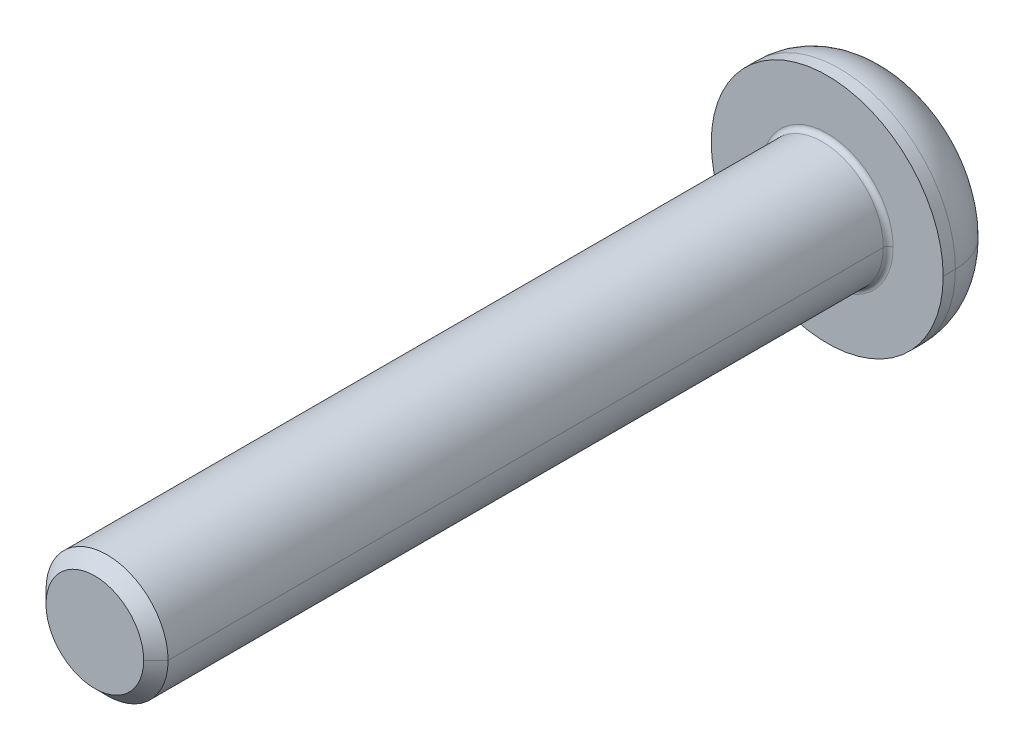
ISO-10303-21;
HEADER;
FILE_DESCRIPTION(('STEP AP214'),'2;1');
FILE_NAME('part.step','',(''),(''),'','','');
FILE_SCHEMA(('AUTOMOTIVE_DESIGN { 1 0 10303 214 1 1 1 1 }'));
ENDSEC;
DATA;
#1=APPLICATION_CONTEXT('core data for automotive mechanical design processes');
#2=APPLICATION_PROTOCOL_DEFINITION('international standard','automotive_design',2000,#1);
#3=PRODUCT_CONTEXT('',#1,'mechanical');
#4=PRODUCT('Part','Part','',(#3));
#5=PRODUCT_RELATED_PRODUCT_CATEGORY('part','',(#4));
#6=PRODUCT_DEFINITION_FORMATION('','',#4);
#7=PRODUCT_DEFINITION_CONTEXT('part definition',#1,'design');
#8=PRODUCT_DEFINITION('design','',#6,#7);
#9=PRODUCT_DEFINITION_SHAPE('','',#8);
#10=(LENGTH_UNIT() NAMED_UNIT(*) SI_UNIT(.MILLI.,.METRE.));
#11=(NAMED_UNIT(*) PLANE_ANGLE_UNIT() SI_UNIT($,.RADIAN.));
#12=(NAMED_UNIT(*) SI_UNIT($,.STERADIAN.) SOLID_ANGLE_UNIT());
#13=UNCERTAINTY_MEASURE_WITH_UNIT(LENGTH_MEASURE(1.E-05),#10,'distance_accuracy_value','');
#14=(GEOMETRIC_REPRESENTATION_CONTEXT(3) GLOBAL_UNCERTAINTY_ASSIGNED_CONTEXT((#13)) GLOBAL_UNIT_ASSIGNED_CONTEXT((#10,
#11,#12)) REPRESENTATION_CONTEXT('',''));
#15=CARTESIAN_POINT('',(0.,0.,0.));
#16=DIRECTION('',(0.,0.,1.));
#17=DIRECTION('',(1.,0.,0.));
#18=AXIS2_PLACEMENT_3D('',#15,#16,#17);
#19=CARTESIAN_POINT('',(0.,0.,0.2));
#20=DIRECTION('',(0.,0.,-1.));
#21=DIRECTION('',(-1.,0.,0.));
#22=AXIS2_PLACEMENT_3D('',#19,#20,#21);
#23=TOROIDAL_SURFACE('',#22,2.7,0.2);
#24=CARTESIAN_POINT('',(2.7,0.,0.2));
#25=DIRECTION('',(0.,1.,0.));
#26=DIRECTION('',(-1.,0.,0.));
#27=AXIS2_PLACEMENT_3D('',#24,#25,#26);
#28=CIRCLE('',#27,0.2);
#29=CARTESIAN_POINT('',(2.7,0.,0.));
#30=VERTEX_POINT('',#29);
#31=CARTESIAN_POINT('',(2.5,0.,0.2));
#32=VERTEX_POINT('',#31);
#33=EDGE_CURVE('E324',#30,#32,#28,.T.);
#34=ORIENTED_EDGE('',*,*,#33,.F.);
#35=CARTESIAN_POINT('',(0.,0.,0.));
#36=DIRECTION('',(0.,0.,-1.));
#37=DIRECTION('',(-1.,0.,0.));
#38=AXIS2_PLACEMENT_3D('',#35,#36,#37);
#39=CIRCLE('',#38,2.7);
#40=CARTESIAN_POINT('',(-2.7,0.,0.));
#41=VERTEX_POINT('',#40);
#42=EDGE_CURVE('E264',#41,#30,#39,.T.);
#43=ORIENTED_EDGE('',*,*,#42,.F.);
#44=CARTESIAN_POINT('',(-2.7,0.,0.2));
#45=DIRECTION('',(0.,-1.,0.));
#46=DIRECTION('',(0.,0.,-1.));
#47=AXIS2_PLACEMENT_3D('',#44,#45,#46);
#48=CIRCLE('',#47,0.2);
#49=CARTESIAN_POINT('',(-2.5,0.,0.2));
#50=VERTEX_POINT('',#49);
#51=EDGE_CURVE('E170',#41,#50,#48,.T.);
#52=ORIENTED_EDGE('',*,*,#51,.T.);
#53=CARTESIAN_POINT('',(0.,0.,0.2));
#54=DIRECTION('',(0.,0.,1.));
#55=DIRECTION('',(-1.,0.,0.));
#56=AXIS2_PLACEMENT_3D('',#53,#54,#55);
#57=CIRCLE('',#56,2.5);
#58=EDGE_CURVE('E197',#32,#50,#57,.T.);
#59=ORIENTED_EDGE('',*,*,#58,.F.);
#60=EDGE_LOOP('',(#34,#43,#52,#59));
#61=FACE_BOUND('',#60,.T.);
#62=ADVANCED_FACE('F18',(#61),#23,.F.);
#63=CARTESIAN_POINT('',(0.,0.,30.));
#64=DIRECTION('',(0.,0.,-1.));
#65=DIRECTION('',(-1.,0.,0.));
#66=AXIS2_PLACEMENT_3D('',#63,#64,#65);
#67=CONICAL_SURFACE('',#66,2.,0.785398163397446);
#68=DIRECTION('',(0.707106781186546,0.,-0.707106781186549));
#69=VECTOR('',#68,1.);
#70=CARTESIAN_POINT('',(2.,0.,30.));
#71=LINE('',#70,#69);
#72=CARTESIAN_POINT('',(2.,0.,30.));
#73=VERTEX_POINT('',#72);
#74=CARTESIAN_POINT('',(2.5,0.,29.5));
#75=VERTEX_POINT('',#74);
#76=EDGE_CURVE('E159',#73,#75,#71,.T.);
#77=ORIENTED_EDGE('',*,*,#76,.F.);
#78=CARTESIAN_POINT('',(0.,0.,30.));
#79=DIRECTION('',(0.,0.,1.));
#80=DIRECTION('',(1.,0.,0.));
#81=AXIS2_PLACEMENT_3D('',#78,#79,#80);
#82=CIRCLE('',#81,2.);
#83=CARTESIAN_POINT('',(-2.,0.,30.));
#84=VERTEX_POINT('',#83);
#85=EDGE_CURVE('E146',#84,#73,#82,.T.);
#86=ORIENTED_EDGE('',*,*,#85,.F.);
#87=DIRECTION('',(-0.707106781186546,0.,-0.707106781186549));
#88=VECTOR('',#87,1.);
#89=CARTESIAN_POINT('',(-2.,0.,30.));
#90=LINE('',#89,#88);
#91=CARTESIAN_POINT('',(-2.5,0.,29.5));
#92=VERTEX_POINT('',#91);
#93=EDGE_CURVE('E168',#84,#92,#90,.T.);
#94=ORIENTED_EDGE('',*,*,#93,.T.);
#95=CARTESIAN_POINT('',(0.,0.,29.5));
#96=DIRECTION('',(0.,0.,-1.));
#97=DIRECTION('',(1.,0.,0.));
#98=AXIS2_PLACEMENT_3D('',#95,#96,#97);
#99=CIRCLE('',#98,2.5);
#100=EDGE_CURVE('E156',#75,#92,#99,.T.);
#101=ORIENTED_EDGE('',*,*,#100,.F.);
#102=EDGE_LOOP('',(#77,#86,#94,#101));
#103=FACE_BOUND('',#102,.T.);
#104=ADVANCED_FACE('F160',(#103),#67,.T.);
#105=CARTESIAN_POINT('',(0.,0.,-0.5));
#106=DIRECTION('',(0.,0.,-1.));
#107=DIRECTION('',(-1.,0.,0.));
#108=AXIS2_PLACEMENT_3D('',#105,#106,#107);
#109=TOROIDAL_SURFACE('',#108,2.5,2.25);
#110=CARTESIAN_POINT('',(2.5,0.,-0.5));
#111=DIRECTION('',(0.,1.,0.));
#112=DIRECTION('',(-1.,0.,0.));
#113=AXIS2_PLACEMENT_3D('',#110,#111,#112);
#114=CIRCLE('',#113,2.25);
#115=CARTESIAN_POINT('',(4.75,0.,-0.5));
#116=VERTEX_POINT('',#115);
#117=CARTESIAN_POINT('',(2.5,0.,-2.75));
#118=VERTEX_POINT('',#117);
#119=EDGE_CURVE('E182',#116,#118,#114,.T.);
#120=ORIENTED_EDGE('',*,*,#119,.F.);
#121=CARTESIAN_POINT('',(0.,0.,-0.5));
#122=DIRECTION('',(0.,0.,1.));
#123=DIRECTION('',(-1.,0.,0.));
#124=AXIS2_PLACEMENT_3D('',#121,#122,#123);
#125=CIRCLE('',#124,4.75);
#126=CARTESIAN_POINT('',(-4.75,0.,-0.5));
#127=VERTEX_POINT('',#126);
#128=EDGE_CURVE('E155',#127,#116,#125,.T.);
#129=ORIENTED_EDGE('',*,*,#128,.F.);
#130=CARTESIAN_POINT('',(-2.5,0.,-0.5));
#131=DIRECTION('',(0.,-1.,0.));
#132=DIRECTION('',(0.,0.,-1.));
#133=AXIS2_PLACEMENT_3D('',#130,#131,#132);
#134=CIRCLE('',#133,2.25);
#135=CARTESIAN_POINT('',(-2.5,0.,-2.75));
#136=VERTEX_POINT('',#135);
#137=EDGE_CURVE('E207',#127,#136,#134,.T.);
#138=ORIENTED_EDGE('',*,*,#137,.T.);
#139=CARTESIAN_POINT('',(0.,0.,-2.75));
#140=DIRECTION('',(0.,0.,-1.));
#141=DIRECTION('',(-1.,0.,0.));
#142=AXIS2_PLACEMENT_3D('',#139,#140,#141);
#143=CIRCLE('',#142,2.5);
#144=EDGE_CURVE('E235',#118,#136,#143,.T.);
#145=ORIENTED_EDGE('',*,*,#144,.F.);
#146=EDGE_LOOP('',(#120,#129,#138,#145));
#147=FACE_BOUND('',#146,.T.);
#148=ADVANCED_FACE('F343',(#147),#109,.T.);
#149=CARTESIAN_POINT('',(0.,0.,-1.19));
#150=DIRECTION('',(0.,0.,-1.));
#151=DIRECTION('',(0.,-1.,0.));
#152=AXIS2_PLACEMENT_3D('',#149,#150,#151);
#153=PLANE('',#152);
#154=DIRECTION('',(-1.,0.,0.));
#155=VECTOR('',#154,1.);
#156=CARTESIAN_POINT('',(0.866025403784439,-1.5,-1.19));
#157=LINE('',#156,#155);
#158=CARTESIAN_POINT('',(0.866025403784439,-1.5,-1.19));
#159=VERTEX_POINT('',#158);
#160=CARTESIAN_POINT('',(-0.866025403784439,-1.5,-1.19));
#161=VERTEX_POINT('',#160);
#162=EDGE_CURVE('E270',#159,#161,#157,.T.);
#163=ORIENTED_EDGE('',*,*,#162,.T.);
#164=DIRECTION('',(-0.5,0.866025403784439,0.));
#165=VECTOR('',#164,1.);
#166=CARTESIAN_POINT('',(-0.866025403784439,-1.5,-1.19));
#167=LINE('',#166,#165);
#168=CARTESIAN_POINT('',(-1.73205080756888,0.,-1.19));
#169=VERTEX_POINT('',#168);
#170=EDGE_CURVE('E11',#161,#169,#167,.T.);
#171=ORIENTED_EDGE('',*,*,#170,.T.);
#172=DIRECTION('',(0.5,0.866025403784439,0.));
#173=VECTOR('',#172,1.);
#174=CARTESIAN_POINT('',(-1.73205080756888,0.,-1.19));
#175=LINE('',#174,#173);
#176=CARTESIAN_POINT('',(-0.86602540378444,1.5,-1.19));
#177=VERTEX_POINT('',#176);
#178=EDGE_CURVE('E47',#169,#177,#175,.T.);
#179=ORIENTED_EDGE('',*,*,#178,.T.);
#180=DIRECTION('',(1.,0.,0.));
#181=VECTOR('',#180,1.);
#182=CARTESIAN_POINT('',(-0.86602540378444,1.5,-1.19));
#183=LINE('',#182,#181);
#184=CARTESIAN_POINT('',(0.866025403784439,1.5,-1.19));
#185=VERTEX_POINT('',#184);
#186=EDGE_CURVE('E282',#177,#185,#183,.T.);
#187=ORIENTED_EDGE('',*,*,#186,.T.);
#188=DIRECTION('',(0.5,-0.866025403784439,0.));
#189=VECTOR('',#188,1.);
#190=CARTESIAN_POINT('',(0.866025403784439,1.5,-1.19));
#191=LINE('',#190,#189);
#192=CARTESIAN_POINT('',(1.73205080756888,0.,-1.19));
#193=VERTEX_POINT('',#192);
#194=EDGE_CURVE('E277',#185,#193,#191,.T.);
#195=ORIENTED_EDGE('',*,*,#194,.T.);
#196=DIRECTION('',(-0.5,-0.866025403784439,0.));
#197=VECTOR('',#196,1.);
#198=CARTESIAN_POINT('',(1.73205080756888,0.,-1.19));
#199=LINE('',#198,#197);
#200=EDGE_CURVE('E188',#193,#159,#199,.T.);
#201=ORIENTED_EDGE('',*,*,#200,.T.);
#202=EDGE_LOOP('',(#163,#171,#179,#187,#195,#201));
#203=FACE_BOUND('',#202,.T.);
#204=ADVANCED_FACE('F309',(#203),#153,.T.);
#205=CARTESIAN_POINT('',(-0.866025403784439,-1.5,-1.19));
#206=DIRECTION('',(-0.866025403784439,-0.5,0.));
#207=DIRECTION('',(-0.5,0.866025403784439,0.));
#208=AXIS2_PLACEMENT_3D('',#205,#206,#207);
#209=PLANE('',#208);
#210=DIRECTION('',(-0.5,0.866025403784439,0.));
#211=VECTOR('',#210,1.);
#212=CARTESIAN_POINT('',(-0.866025403784439,-1.5,-2.75));
#213=LINE('',#212,#211);
#214=CARTESIAN_POINT('',(-0.866025403784439,-1.5,-2.75));
#215=VERTEX_POINT('',#214);
#216=CARTESIAN_POINT('',(-1.73205080756888,0.,-2.75));
#217=VERTEX_POINT('',#216);
#218=EDGE_CURVE('E260',#215,#217,#213,.T.);
#219=ORIENTED_EDGE('',*,*,#218,.T.);
#220=DIRECTION('',(0.,0.,-1.));
#221=VECTOR('',#220,1.);
#222=CARTESIAN_POINT('',(-1.73205080756888,0.,-1.19));
#223=LINE('',#222,#221);
#224=EDGE_CURVE('E27',#169,#217,#223,.T.);
#225=ORIENTED_EDGE('',*,*,#224,.F.);
#226=ORIENTED_EDGE('',*,*,#170,.F.);
#227=DIRECTION('',(0.,0.,-1.));
#228=VECTOR('',#227,1.);
#229=CARTESIAN_POINT('',(-0.866025403784439,-1.5,-1.19));
#230=LINE('',#229,#228);
#231=EDGE_CURVE('E267',#161,#215,#230,.T.);
#232=ORIENTED_EDGE('',*,*,#231,.T.);
#233=EDGE_LOOP('',(#219,#225,#226,#232));
#234=FACE_BOUND('',#233,.T.);
#235=ADVANCED_FACE('F318',(#234),#209,.F.);
#236=CARTESIAN_POINT('',(-1.73205080756888,0.,-1.19));
#237=DIRECTION('',(-0.866025403784439,0.5,0.));
#238=DIRECTION('',(0.,0.,1.));
#239=AXIS2_PLACEMENT_3D('',#236,#237,#238);
#240=PLANE('',#239);
#241=DIRECTION('',(0.5,0.866025403784439,0.));
#242=VECTOR('',#241,1.);
#243=CARTESIAN_POINT('',(-1.73205080756888,0.,-2.75));
#244=LINE('',#243,#242);
#245=CARTESIAN_POINT('',(-0.86602540378444,1.5,-2.75));
#246=VERTEX_POINT('',#245);
#247=EDGE_CURVE('E255',#217,#246,#244,.T.);
#248=ORIENTED_EDGE('',*,*,#247,.T.);
#249=DIRECTION('',(0.,0.,-1.));
#250=VECTOR('',#249,1.);
#251=CARTESIAN_POINT('',(-0.86602540378444,1.5,-1.19));
#252=LINE('',#251,#250);
#253=EDGE_CURVE('E21',#177,#246,#252,.T.);
#254=ORIENTED_EDGE('',*,*,#253,.F.);
#255=ORIENTED_EDGE('',*,*,#178,.F.);
#256=ORIENTED_EDGE('',*,*,#224,.T.);
#257=EDGE_LOOP('',(#248,#254,#255,#256));
#258=FACE_BOUND('',#257,.T.);
#259=ADVANCED_FACE('F297',(#258),#240,.F.);
#260=CARTESIAN_POINT('',(-0.86602540378444,1.5,-1.19));
#261=DIRECTION('',(0.,1.,0.));
#262=DIRECTION('',(1.,0.,0.));
#263=AXIS2_PLACEMENT_3D('',#260,#261,#262);
#264=PLANE('',#263);
#265=DIRECTION('',(1.,0.,0.));
#266=VECTOR('',#265,1.);
#267=CARTESIAN_POINT('',(-0.86602540378444,1.5,-2.75));
#268=LINE('',#267,#266);
#269=CARTESIAN_POINT('',(0.866025403784439,1.5,-2.75));
#270=VERTEX_POINT('',#269);
#271=EDGE_CURVE('E252',#246,#270,#268,.T.);
#272=ORIENTED_EDGE('',*,*,#271,.T.);
#273=DIRECTION('',(0.,0.,-1.));
#274=VECTOR('',#273,1.);
#275=CARTESIAN_POINT('',(0.866025403784439,1.5,-1.19));
#276=LINE('',#275,#274);
#277=EDGE_CURVE('E280',#185,#270,#276,.T.);
#278=ORIENTED_EDGE('',*,*,#277,.F.);
#279=ORIENTED_EDGE('',*,*,#186,.F.);
#280=ORIENTED_EDGE('',*,*,#253,.T.);
#281=EDGE_LOOP('',(#272,#278,#279,#280));
#282=FACE_BOUND('',#281,.T.);
#283=ADVANCED_FACE('F292',(#282),#264,.F.);
#284=CARTESIAN_POINT('',(0.866025403784439,1.5,-1.19));
#285=DIRECTION('',(0.866025403784439,0.5,0.));
#286=DIRECTION('',(0.,0.,-1.));
#287=AXIS2_PLACEMENT_3D('',#284,#285,#286);
#288=PLANE('',#287);
#289=DIRECTION('',(0.5,-0.866025403784439,0.));
#290=VECTOR('',#289,1.);
#291=CARTESIAN_POINT('',(0.866025403784439,1.5,-2.75));
#292=LINE('',#291,#290);
#293=CARTESIAN_POINT('',(1.73205080756888,0.,-2.75));
#294=VERTEX_POINT('',#293);
#295=EDGE_CURVE('E246',#270,#294,#292,.T.);
#296=ORIENTED_EDGE('',*,*,#295,.T.);
#297=DIRECTION('',(0.,0.,-1.));
#298=VECTOR('',#297,1.);
#299=CARTESIAN_POINT('',(1.73205080756888,0.,-1.19));
#300=LINE('',#299,#298);
#301=EDGE_CURVE('E191',#193,#294,#300,.T.);
#302=ORIENTED_EDGE('',*,*,#301,.F.);
#303=ORIENTED_EDGE('',*,*,#194,.F.);
#304=ORIENTED_EDGE('',*,*,#277,.T.);
#305=EDGE_LOOP('',(#296,#302,#303,#304));
#306=FACE_BOUND('',#305,.T.);
#307=ADVANCED_FACE('F306',(#306),#288,.F.);
#308=CARTESIAN_POINT('',(1.73205080756888,0.,-1.19));
#309=DIRECTION('',(0.866025403784439,-0.5,0.));
#310=DIRECTION('',(0.,0.,-1.));
#311=AXIS2_PLACEMENT_3D('',#308,#309,#310);
#312=PLANE('',#311);
#313=DIRECTION('',(-0.5,-0.866025403784439,0.));
#314=VECTOR('',#313,1.);
#315=CARTESIAN_POINT('',(1.73205080756888,0.,-2.75));
#316=LINE('',#315,#314);
#317=CARTESIAN_POINT('',(0.866025403784439,-1.5,-2.75));
#318=VERTEX_POINT('',#317);
#319=EDGE_CURVE('E242',#294,#318,#316,.T.);
#320=ORIENTED_EDGE('',*,*,#319,.T.);
#321=DIRECTION('',(0.,0.,-1.));
#322=VECTOR('',#321,1.);
#323=CARTESIAN_POINT('',(0.866025403784439,-1.5,-1.19));
#324=LINE('',#323,#322);
#325=EDGE_CURVE('E192',#159,#318,#324,.T.);
#326=ORIENTED_EDGE('',*,*,#325,.F.);
#327=ORIENTED_EDGE('',*,*,#200,.F.);
#328=ORIENTED_EDGE('',*,*,#301,.T.);
#329=EDGE_LOOP('',(#320,#326,#327,#328));
#330=FACE_BOUND('',#329,.T.);
#331=ADVANCED_FACE('F314',(#330),#312,.F.);
#332=CARTESIAN_POINT('',(0.866025403784439,-1.5,-1.19));
#333=DIRECTION('',(0.,-1.,0.));
#334=DIRECTION('',(-1.,0.,0.));
#335=AXIS2_PLACEMENT_3D('',#332,#333,#334);
#336=PLANE('',#335);
#337=DIRECTION('',(-1.,0.,0.));
#338=VECTOR('',#337,1.);
#339=CARTESIAN_POINT('',(0.866025403784439,-1.5,-2.75));
#340=LINE('',#339,#338);
#341=EDGE_CURVE('E238',#318,#215,#340,.T.);
#342=ORIENTED_EDGE('',*,*,#341,.T.);
#343=ORIENTED_EDGE('',*,*,#231,.F.);
#344=ORIENTED_EDGE('',*,*,#162,.F.);
#345=ORIENTED_EDGE('',*,*,#325,.T.);
#346=EDGE_LOOP('',(#342,#343,#344,#345));
#347=FACE_BOUND('',#346,.T.);
#348=ADVANCED_FACE('F316',(#347),#336,.F.);
#349=CARTESIAN_POINT('',(0.,0.,0.));
#350=DIRECTION('',(0.,0.,-1.));
#351=DIRECTION('',(0.,-1.,0.));
#352=AXIS2_PLACEMENT_3D('',#349,#350,#351);
#353=PLANE('',#352);
#354=ORIENTED_EDGE('',*,*,#42,.T.);
#355=CARTESIAN_POINT('',(0.,0.,0.));
#356=DIRECTION('',(0.,0.,-1.));
#357=DIRECTION('',(-1.,0.,0.));
#358=AXIS2_PLACEMENT_3D('',#355,#356,#357);
#359=CIRCLE('',#358,2.7);
#360=EDGE_CURVE('E367',#30,#41,#359,.T.);
#361=ORIENTED_EDGE('',*,*,#360,.T.);
#362=EDGE_LOOP('',(#354,#361));
#363=FACE_BOUND('',#362,.T.);
#364=CARTESIAN_POINT('',(0.,0.,0.));
#365=DIRECTION('',(0.,0.,-1.));
#366=DIRECTION('',(-1.,0.,0.));
#367=AXIS2_PLACEMENT_3D('',#364,#365,#366);
#368=CIRCLE('',#367,4.75);
#369=CARTESIAN_POINT('',(4.75,0.,0.));
#370=VERTEX_POINT('',#369);
#371=CARTESIAN_POINT('',(-4.75,0.,0.));
#372=VERTEX_POINT('',#371);
#373=EDGE_CURVE('E232',#370,#372,#368,.T.);
#374=ORIENTED_EDGE('',*,*,#373,.F.);
#375=CARTESIAN_POINT('',(0.,0.,0.));
#376=DIRECTION('',(0.,0.,-1.));
#377=DIRECTION('',(-1.,0.,0.));
#378=AXIS2_PLACEMENT_3D('',#375,#376,#377);
#379=CIRCLE('',#378,4.75);
#380=EDGE_CURVE('E215',#372,#370,#379,.T.);
#381=ORIENTED_EDGE('',*,*,#380,.F.);
#382=EDGE_LOOP('',(#374,#381));
#383=FACE_BOUND('',#382,.T.);
#384=ADVANCED_FACE('F345',(#363,#383),#353,.F.);
#385=CARTESIAN_POINT('',(0.,0.,-2.75));
#386=DIRECTION('',(0.,0.,-1.));
#387=DIRECTION('',(0.,-1.,0.));
#388=AXIS2_PLACEMENT_3D('',#385,#386,#387);
#389=PLANE('',#388);
#390=ORIENTED_EDGE('',*,*,#341,.F.);
#391=ORIENTED_EDGE('',*,*,#319,.F.);
#392=ORIENTED_EDGE('',*,*,#295,.F.);
#393=ORIENTED_EDGE('',*,*,#271,.F.);
#394=ORIENTED_EDGE('',*,*,#247,.F.);
#395=ORIENTED_EDGE('',*,*,#218,.F.);
#396=EDGE_LOOP('',(#390,#391,#392,#393,#394,#395));
#397=FACE_BOUND('',#396,.T.);
#398=CARTESIAN_POINT('',(0.,0.,-2.75));
#399=DIRECTION('',(0.,0.,-1.));
#400=DIRECTION('',(-1.,0.,0.));
#401=AXIS2_PLACEMENT_3D('',#398,#399,#400);
#402=CIRCLE('',#401,2.5);
#403=EDGE_CURVE('E185',#136,#118,#402,.T.);
#404=ORIENTED_EDGE('',*,*,#403,.T.);
#405=ORIENTED_EDGE('',*,*,#144,.T.);
#406=EDGE_LOOP('',(#404,#405));
#407=FACE_BOUND('',#406,.T.);
#408=ADVANCED_FACE('F301',(#397,#407),#389,.T.);
#409=CARTESIAN_POINT('',(0.,0.,-2.75));
#410=DIRECTION('',(0.,0.,1.));
#411=DIRECTION('',(1.,0.,0.));
#412=AXIS2_PLACEMENT_3D('',#409,#410,#411);
#413=CYLINDRICAL_SURFACE('',#412,4.75);
#414=DIRECTION('',(0.,0.,1.));
#415=VECTOR('',#414,1.);
#416=CARTESIAN_POINT('',(-4.75,0.,-2.75));
#417=LINE('',#416,#415);
#418=EDGE_CURVE('E211',#127,#372,#417,.T.);
#419=ORIENTED_EDGE('',*,*,#418,.F.);
#420=ORIENTED_EDGE('',*,*,#128,.T.);
#421=DIRECTION('',(0.,0.,1.));
#422=VECTOR('',#421,1.);
#423=CARTESIAN_POINT('',(4.75,0.,-2.75));
#424=LINE('',#423,#422);
#425=EDGE_CURVE('E198',#116,#370,#424,.T.);
#426=ORIENTED_EDGE('',*,*,#425,.T.);
#427=ORIENTED_EDGE('',*,*,#373,.T.);
#428=EDGE_LOOP('',(#419,#420,#426,#427));
#429=FACE_BOUND('',#428,.T.);
#430=ADVANCED_FACE('F337',(#429),#413,.T.);
#431=CARTESIAN_POINT('',(0.,0.,30.));
#432=DIRECTION('',(0.,0.,1.));
#433=DIRECTION('',(1.,0.,0.));
#434=AXIS2_PLACEMENT_3D('',#431,#432,#433);
#435=PLANE('',#434);
#436=ORIENTED_EDGE('',*,*,#85,.T.);
#437=CARTESIAN_POINT('',(0.,0.,30.));
#438=DIRECTION('',(0.,0.,1.));
#439=DIRECTION('',(1.,0.,0.));
#440=AXIS2_PLACEMENT_3D('',#437,#438,#439);
#441=CIRCLE('',#440,2.);
#442=EDGE_CURVE('E150',#73,#84,#441,.T.);
#443=ORIENTED_EDGE('',*,*,#442,.T.);
#444=EDGE_LOOP('',(#436,#443));
#445=FACE_BOUND('',#444,.T.);
#446=ADVANCED_FACE('F148',(#445),#435,.T.);
#447=CARTESIAN_POINT('',(0.,0.,30.));
#448=DIRECTION('',(0.,0.,-1.));
#449=DIRECTION('',(-1.,0.,0.));
#450=AXIS2_PLACEMENT_3D('',#447,#448,#449);
#451=CYLINDRICAL_SURFACE('',#450,2.5);
#452=DIRECTION('',(0.,0.,-1.));
#453=VECTOR('',#452,1.);
#454=CARTESIAN_POINT('',(2.5,0.,30.));
#455=LINE('',#454,#453);
#456=EDGE_CURVE('E193',#75,#32,#455,.T.);
#457=ORIENTED_EDGE('',*,*,#456,.F.);
#458=ORIENTED_EDGE('',*,*,#100,.T.);
#459=DIRECTION('',(0.,0.,-1.));
#460=VECTOR('',#459,1.);
#461=CARTESIAN_POINT('',(-2.5,0.,30.));
#462=LINE('',#461,#460);
#463=EDGE_CURVE('E225',#92,#50,#462,.T.);
#464=ORIENTED_EDGE('',*,*,#463,.T.);
#465=CARTESIAN_POINT('',(0.,0.,0.2));
#466=DIRECTION('',(0.,0.,1.));
#467=DIRECTION('',(-1.,0.,0.));
#468=AXIS2_PLACEMENT_3D('',#465,#466,#467);
#469=CIRCLE('',#468,2.5);
#470=EDGE_CURVE('E177',#50,#32,#469,.T.);
#471=ORIENTED_EDGE('',*,*,#470,.T.);
#472=EDGE_LOOP('',(#457,#458,#464,#471));
#473=FACE_BOUND('',#472,.T.);
#474=ADVANCED_FACE('F552',(#473),#451,.T.);
#475=CARTESIAN_POINT('',(0.,0.,30.));
#476=DIRECTION('',(0.,0.,-1.));
#477=DIRECTION('',(-1.,0.,0.));
#478=AXIS2_PLACEMENT_3D('',#475,#476,#477);
#479=CYLINDRICAL_SURFACE('',#478,2.5);
#480=CARTESIAN_POINT('',(0.,0.,29.5));
#481=DIRECTION('',(0.,0.,-1.));
#482=DIRECTION('',(1.,0.,0.));
#483=AXIS2_PLACEMENT_3D('',#480,#481,#482);
#484=CIRCLE('',#483,2.5);
#485=EDGE_CURVE('E165',#92,#75,#484,.T.);
#486=ORIENTED_EDGE('',*,*,#485,.T.);
#487=ORIENTED_EDGE('',*,*,#456,.T.);
#488=ORIENTED_EDGE('',*,*,#58,.T.);
#489=ORIENTED_EDGE('',*,*,#463,.F.);
#490=EDGE_LOOP('',(#486,#487,#488,#489));
#491=FACE_BOUND('',#490,.T.);
#492=ADVANCED_FACE('F596',(#491),#479,.T.);
#493=CARTESIAN_POINT('',(0.,0.,-2.75));
#494=DIRECTION('',(0.,0.,1.));
#495=DIRECTION('',(1.,0.,0.));
#496=AXIS2_PLACEMENT_3D('',#493,#494,#495);
#497=CYLINDRICAL_SURFACE('',#496,4.75);
#498=CARTESIAN_POINT('',(0.,0.,-0.5));
#499=DIRECTION('',(0.,0.,1.));
#500=DIRECTION('',(-1.,0.,0.));
#501=AXIS2_PLACEMENT_3D('',#498,#499,#500);
#502=CIRCLE('',#501,4.75);
#503=EDGE_CURVE('E186',#116,#127,#502,.T.);
#504=ORIENTED_EDGE('',*,*,#503,.T.);
#505=ORIENTED_EDGE('',*,*,#418,.T.);
#506=ORIENTED_EDGE('',*,*,#380,.T.);
#507=ORIENTED_EDGE('',*,*,#425,.F.);
#508=EDGE_LOOP('',(#504,#505,#506,#507));
#509=FACE_BOUND('',#508,.T.);
#510=ADVANCED_FACE('F331',(#509),#497,.T.);
#511=CARTESIAN_POINT('',(0.,0.,-0.5));
#512=DIRECTION('',(0.,0.,-1.));
#513=DIRECTION('',(-1.,0.,0.));
#514=AXIS2_PLACEMENT_3D('',#511,#512,#513);
#515=TOROIDAL_SURFACE('',#514,2.5,2.25);
#516=ORIENTED_EDGE('',*,*,#503,.F.);
#517=ORIENTED_EDGE('',*,*,#119,.T.);
#518=ORIENTED_EDGE('',*,*,#403,.F.);
#519=ORIENTED_EDGE('',*,*,#137,.F.);
#520=EDGE_LOOP('',(#516,#517,#518,#519));
#521=FACE_BOUND('',#520,.T.);
#522=ADVANCED_FACE('F340',(#521),#515,.T.);
#523=CARTESIAN_POINT('',(0.,0.,30.));
#524=DIRECTION('',(0.,0.,-1.));
#525=DIRECTION('',(-1.,0.,0.));
#526=AXIS2_PLACEMENT_3D('',#523,#524,#525);
#527=CONICAL_SURFACE('',#526,2.,0.785398163397446);
#528=ORIENTED_EDGE('',*,*,#442,.F.);
#529=ORIENTED_EDGE('',*,*,#76,.T.);
#530=ORIENTED_EDGE('',*,*,#485,.F.);
#531=ORIENTED_EDGE('',*,*,#93,.F.);
#532=EDGE_LOOP('',(#528,#529,#530,#531));
#533=FACE_BOUND('',#532,.T.);
#534=ADVANCED_FACE('F167',(#533),#527,.T.);
#535=CARTESIAN_POINT('',(0.,0.,0.2));
#536=DIRECTION('',(0.,0.,-1.));
#537=DIRECTION('',(-1.,0.,0.));
#538=AXIS2_PLACEMENT_3D('',#535,#536,#537);
#539=TOROIDAL_SURFACE('',#538,2.7,0.2);
#540=ORIENTED_EDGE('',*,*,#360,.F.);
#541=ORIENTED_EDGE('',*,*,#33,.T.);
#542=ORIENTED_EDGE('',*,*,#470,.F.);
#543=ORIENTED_EDGE('',*,*,#51,.F.);
#544=EDGE_LOOP('',(#540,#541,#542,#543));
#545=FACE_BOUND('',#544,.T.);
#546=ADVANCED_FACE('F369',(#545),#539,.F.);
#547=CLOSED_SHELL('',(#62,#104,#148,#204,#235,#259,#283,#307,#331,#348,#384,#408,#430,#446,#474,
#492,#510,#522,#534,#546));
#548=MANIFOLD_SOLID_BREP('B1',#547);
#549=ADVANCED_BREP_SHAPE_REPRESENTATION('',(#18,#548),#14);
#550=SHAPE_DEFINITION_REPRESENTATION(#9,#549);
ENDSEC;
END-ISO-10303-21;
